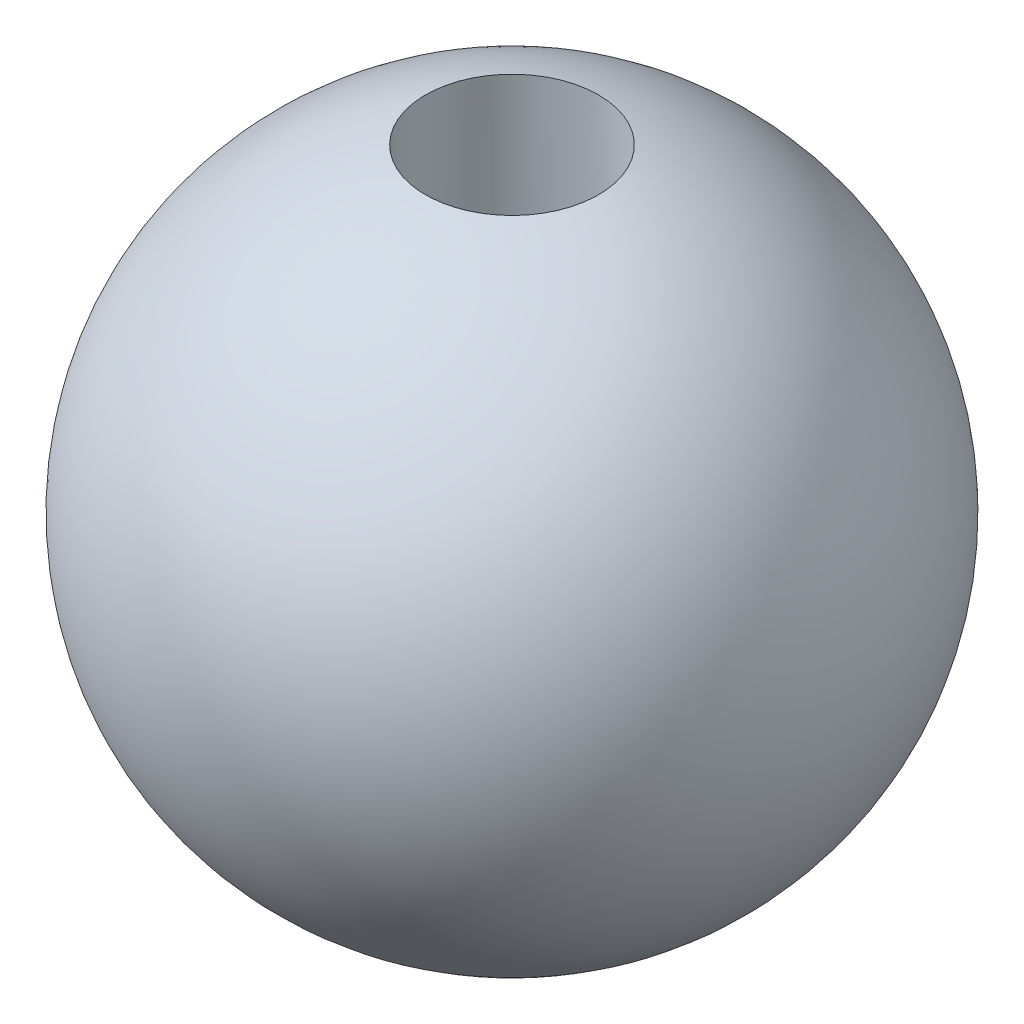
ISO-10303-21;
HEADER;
FILE_DESCRIPTION(('STEP AP214'),'2;1');
FILE_NAME('part.step','',(''),(''),'','','');
FILE_SCHEMA(('AUTOMOTIVE_DESIGN { 1 0 10303 214 1 1 1 1 }'));
ENDSEC;
DATA;
#1=APPLICATION_CONTEXT('core data for automotive mechanical design processes');
#2=APPLICATION_PROTOCOL_DEFINITION('international standard','automotive_design',2000,#1);
#3=PRODUCT_CONTEXT('',#1,'mechanical');
#4=PRODUCT('Part','Part','',(#3));
#5=PRODUCT_RELATED_PRODUCT_CATEGORY('part','',(#4));
#6=PRODUCT_DEFINITION_FORMATION('','',#4);
#7=PRODUCT_DEFINITION_CONTEXT('part definition',#1,'design');
#8=PRODUCT_DEFINITION('design','',#6,#7);
#9=PRODUCT_DEFINITION_SHAPE('','',#8);
#10=(LENGTH_UNIT() NAMED_UNIT(*) SI_UNIT(.MILLI.,.METRE.));
#11=(NAMED_UNIT(*) PLANE_ANGLE_UNIT() SI_UNIT($,.RADIAN.));
#12=(NAMED_UNIT(*) SI_UNIT($,.STERADIAN.) SOLID_ANGLE_UNIT());
#13=UNCERTAINTY_MEASURE_WITH_UNIT(LENGTH_MEASURE(1.E-05),#10,'distance_accuracy_value','');
#14=(GEOMETRIC_REPRESENTATION_CONTEXT(3) GLOBAL_UNCERTAINTY_ASSIGNED_CONTEXT((#13)) GLOBAL_UNIT_ASSIGNED_CONTEXT((#10,
#11,#12)) REPRESENTATION_CONTEXT('',''));
#15=CARTESIAN_POINT('',(0.,0.,0.));
#16=DIRECTION('',(0.,0.,1.));
#17=DIRECTION('',(1.,0.,0.));
#18=AXIS2_PLACEMENT_3D('',#15,#16,#17);
#19=CARTESIAN_POINT('',(16.25,-11.5,0.));
#20=DIRECTION('',(0.,-1.,0.));
#21=DIRECTION('',(0.,0.,-1.));
#22=AXIS2_PLACEMENT_3D('',#19,#20,#21);
#23=PLANE('',#22);
#24=DIRECTION('',(0.,0.,-1.));
#25=VECTOR('',#24,1.);
#26=CARTESIAN_POINT('',(14.25,-11.5,2.23606797749979));
#27=LINE('',#26,#25);
#28=CARTESIAN_POINT('',(14.25,-11.5,2.23606797749979));
#29=VERTEX_POINT('',#28);
#30=CARTESIAN_POINT('',(14.25,-11.5,-2.23606797749979));
#31=VERTEX_POINT('',#30);
#32=EDGE_CURVE('E89',#29,#31,#27,.T.);
#33=ORIENTED_EDGE('',*,*,#32,.F.);
#34=CARTESIAN_POINT('',(16.25,-11.5,0.));
#35=DIRECTION('',(0.,-1.,0.));
#36=DIRECTION('',(0.,0.,-1.));
#37=AXIS2_PLACEMENT_3D('',#34,#35,#36);
#38=CIRCLE('',#37,3.);
#39=EDGE_CURVE('E117',#29,#31,#38,.T.);
#40=ORIENTED_EDGE('',*,*,#39,.T.);
#41=EDGE_LOOP('',(#33,#40));
#42=FACE_BOUND('',#41,.T.);
#43=ADVANCED_FACE('F37',(#42),#23,.T.);
#44=CARTESIAN_POINT('',(16.25,0.,0.));
#45=DIRECTION('',(-1.,0.,0.));
#46=DIRECTION('',(0.,1.,0.));
#47=AXIS2_PLACEMENT_3D('',#44,#45,#46);
#48=SPHERICAL_SURFACE('',#47,16.25);
#49=CARTESIAN_POINT('',(16.25,0.,0.));
#50=DIRECTION('',(0.,-1.,0.));
#51=DIRECTION('',(0.,0.,-1.));
#52=AXIS2_PLACEMENT_3D('',#49,#50,#51);
#53=SPHERICAL_SURFACE('',#52,16.25);
#54=CARTESIAN_POINT('',(16.25,15.6796210399847,0.));
#55=DIRECTION('',(0.,-1.,0.));
#56=DIRECTION('',(0.,0.,-1.));
#57=AXIS2_PLACEMENT_3D('',#54,#55,#56);
#58=CIRCLE('',#57,4.26755012184662);
#59=CARTESIAN_POINT('',(16.25,15.6796210399847,-4.26755012184662));
#60=VERTEX_POINT('',#59);
#61=EDGE_CURVE('E12',#60,#60,#58,.T.);
#62=ORIENTED_EDGE('',*,*,#61,.T.);
#63=EDGE_LOOP('',(#62));
#64=FACE_BOUND('',#63,.T.);
#65=CARTESIAN_POINT('',(16.25,-15.4616460960662,0.));
#66=DIRECTION('',(0.,1.,0.));
#67=DIRECTION('',(0.,0.,1.));
#68=AXIS2_PLACEMENT_3D('',#65,#66,#67);
#69=CIRCLE('',#68,5.);
#70=CARTESIAN_POINT('',(16.25,-15.4616460960662,5.));
#71=VERTEX_POINT('',#70);
#72=EDGE_CURVE('E41',#71,#71,#69,.F.);
#73=ORIENTED_EDGE('',*,*,#72,.F.);
#74=EDGE_LOOP('',(#73));
#75=FACE_BOUND('',#74,.T.);
#76=ADVANCED_FACE('F39',(#64,#75),#53,.T.);
#77=CARTESIAN_POINT('',(16.25,16.25,0.));
#78=DIRECTION('',(0.,-1.,0.));
#79=DIRECTION('',(0.,0.,-1.));
#80=AXIS2_PLACEMENT_3D('',#77,#78,#79);
#81=CONICAL_SURFACE('',#80,4.25,0.0307595260704694);
#82=CARTESIAN_POINT('',(16.25,0.,0.));
#83=DIRECTION('',(0.,1.,0.));
#84=DIRECTION('',(0.,0.,1.));
#85=AXIS2_PLACEMENT_3D('',#82,#83,#84);
#86=CIRCLE('',#85,4.75);
#87=CARTESIAN_POINT('',(16.25,0.,4.75));
#88=VERTEX_POINT('',#87);
#89=EDGE_CURVE('E46',#88,#88,#86,.T.);
#90=ORIENTED_EDGE('',*,*,#89,.F.);
#91=EDGE_LOOP('',(#90));
#92=FACE_BOUND('',#91,.T.);
#93=ORIENTED_EDGE('',*,*,#61,.F.);
#94=EDGE_LOOP('',(#93));
#95=FACE_BOUND('',#94,.T.);
#96=ADVANCED_FACE('F130',(#92,#95),#81,.F.);
#97=CARTESIAN_POINT('',(16.25,0.,0.));
#98=DIRECTION('',(0.,1.,0.));
#99=DIRECTION('',(0.,0.,1.));
#100=AXIS2_PLACEMENT_3D('',#97,#98,#99);
#101=PLANE('',#100);
#102=ORIENTED_EDGE('',*,*,#89,.T.);
#103=EDGE_LOOP('',(#102));
#104=FACE_BOUND('',#103,.T.);
#105=ADVANCED_FACE('F139',(#104),#101,.T.);
#106=CARTESIAN_POINT('',(16.25,-14.,0.));
#107=DIRECTION('',(0.,-1.,0.));
#108=DIRECTION('',(0.,0.,-1.));
#109=AXIS2_PLACEMENT_3D('',#106,#107,#108);
#110=CYLINDRICAL_SURFACE('',#109,5.);
#111=CARTESIAN_POINT('',(16.25,-14.,0.));
#112=DIRECTION('',(0.,1.,0.));
#113=DIRECTION('',(0.,0.,1.));
#114=AXIS2_PLACEMENT_3D('',#111,#112,#113);
#115=CIRCLE('',#114,5.);
#116=CARTESIAN_POINT('',(16.25,-14.,5.));
#117=VERTEX_POINT('',#116);
#118=EDGE_CURVE('E116',#117,#117,#115,.T.);
#119=ORIENTED_EDGE('',*,*,#118,.T.);
#120=EDGE_LOOP('',(#119));
#121=FACE_BOUND('',#120,.T.);
#122=ORIENTED_EDGE('',*,*,#72,.T.);
#123=EDGE_LOOP('',(#122));
#124=FACE_BOUND('',#123,.T.);
#125=ADVANCED_FACE('F143',(#121,#124),#110,.F.);
#126=CARTESIAN_POINT('',(16.25,-14.,0.));
#127=DIRECTION('',(0.,1.,0.));
#128=DIRECTION('',(0.,0.,1.));
#129=AXIS2_PLACEMENT_3D('',#126,#127,#128);
#130=PLANE('',#129);
#131=CARTESIAN_POINT('',(16.25,-14.,0.));
#132=DIRECTION('',(0.,-1.,0.));
#133=DIRECTION('',(0.,0.,-1.));
#134=AXIS2_PLACEMENT_3D('',#131,#132,#133);
#135=CIRCLE('',#134,3.);
#136=CARTESIAN_POINT('',(16.25,-14.,-3.));
#137=VERTEX_POINT('',#136);
#138=EDGE_CURVE('E110',#137,#137,#135,.T.);
#139=ORIENTED_EDGE('',*,*,#138,.F.);
#140=EDGE_LOOP('',(#139));
#141=FACE_BOUND('',#140,.T.);
#142=ORIENTED_EDGE('',*,*,#118,.F.);
#143=EDGE_LOOP('',(#142));
#144=FACE_BOUND('',#143,.T.);
#145=ADVANCED_FACE('F182',(#141,#144),#130,.F.);
#146=CARTESIAN_POINT('',(16.25,-11.5,0.));
#147=DIRECTION('',(0.,-1.,0.));
#148=DIRECTION('',(0.,0.,-1.));
#149=AXIS2_PLACEMENT_3D('',#146,#147,#148);
#150=CYLINDRICAL_SURFACE('',#149,3.);
#151=CARTESIAN_POINT('',(18.25,-11.5,-2.23606797749979));
#152=VERTEX_POINT('',#151);
#153=CARTESIAN_POINT('',(18.25,-11.5,2.23606797749979));
#154=VERTEX_POINT('',#153);
#155=EDGE_CURVE('E113',#152,#154,#38,.T.);
#156=ORIENTED_EDGE('',*,*,#155,.F.);
#157=DIRECTION('',(0.,-1.,0.));
#158=VECTOR('',#157,1.);
#159=CARTESIAN_POINT('',(18.25,-4.5,-2.23606797749979));
#160=LINE('',#159,#158);
#161=CARTESIAN_POINT('',(18.25,-4.5,-2.23606797749979));
#162=VERTEX_POINT('',#161);
#163=EDGE_CURVE('E53',#162,#152,#160,.T.);
#164=ORIENTED_EDGE('',*,*,#163,.F.);
#165=CARTESIAN_POINT('',(16.25,-4.5,0.));
#166=DIRECTION('',(0.,-1.,0.));
#167=DIRECTION('',(0.,0.,-1.));
#168=AXIS2_PLACEMENT_3D('',#165,#166,#167);
#169=CIRCLE('',#168,3.);
#170=CARTESIAN_POINT('',(14.25,-4.5,-2.23606797749979));
#171=VERTEX_POINT('',#170);
#172=EDGE_CURVE('E93',#171,#162,#169,.T.);
#173=ORIENTED_EDGE('',*,*,#172,.F.);
#174=DIRECTION('',(0.,-1.,0.));
#175=VECTOR('',#174,1.);
#176=CARTESIAN_POINT('',(14.25,-4.5,-2.23606797749979));
#177=LINE('',#176,#175);
#178=EDGE_CURVE('E82',#171,#31,#177,.T.);
#179=ORIENTED_EDGE('',*,*,#178,.T.);
#180=ORIENTED_EDGE('',*,*,#39,.F.);
#181=DIRECTION('',(0.,-1.,0.));
#182=VECTOR('',#181,1.);
#183=CARTESIAN_POINT('',(14.25,-4.5,2.23606797749979));
#184=LINE('',#183,#182);
#185=CARTESIAN_POINT('',(14.25,-4.5,2.23606797749979));
#186=VERTEX_POINT('',#185);
#187=EDGE_CURVE('E77',#186,#29,#184,.T.);
#188=ORIENTED_EDGE('',*,*,#187,.F.);
#189=CARTESIAN_POINT('',(16.25,-4.5,0.));
#190=DIRECTION('',(0.,-1.,0.));
#191=DIRECTION('',(0.,0.,-1.));
#192=AXIS2_PLACEMENT_3D('',#189,#190,#191);
#193=CIRCLE('',#192,3.);
#194=CARTESIAN_POINT('',(18.25,-4.5,2.23606797749979));
#195=VERTEX_POINT('',#194);
#196=EDGE_CURVE('E101',#195,#186,#193,.T.);
#197=ORIENTED_EDGE('',*,*,#196,.F.);
#198=DIRECTION('',(0.,-1.,0.));
#199=VECTOR('',#198,1.);
#200=CARTESIAN_POINT('',(18.25,-4.5,2.23606797749979));
#201=LINE('',#200,#199);
#202=EDGE_CURVE('E59',#195,#154,#201,.T.);
#203=ORIENTED_EDGE('',*,*,#202,.T.);
#204=EDGE_LOOP('',(#156,#164,#173,#179,#180,#188,#197,#203));
#205=FACE_BOUND('',#204,.T.);
#206=ORIENTED_EDGE('',*,*,#138,.T.);
#207=EDGE_LOOP('',(#206));
#208=FACE_BOUND('',#207,.T.);
#209=ADVANCED_FACE('F94',(#205,#208),#150,.F.);
#210=DIRECTION('',(0.,0.,1.));
#211=VECTOR('',#210,1.);
#212=CARTESIAN_POINT('',(18.25,-11.5,2.23606797749979));
#213=LINE('',#212,#211);
#214=EDGE_CURVE('E103',#152,#154,#213,.T.);
#215=ORIENTED_EDGE('',*,*,#214,.F.);
#216=ORIENTED_EDGE('',*,*,#155,.T.);
#217=EDGE_LOOP('',(#215,#216));
#218=FACE_BOUND('',#217,.T.);
#219=ADVANCED_FACE('F167',(#218),#23,.T.);
#220=CARTESIAN_POINT('',(18.25,-4.5,2.23606797749979));
#221=DIRECTION('',(1.,0.,0.));
#222=DIRECTION('',(0.,0.,-1.));
#223=AXIS2_PLACEMENT_3D('',#220,#221,#222);
#224=PLANE('',#223);
#225=ORIENTED_EDGE('',*,*,#214,.T.);
#226=ORIENTED_EDGE('',*,*,#202,.F.);
#227=DIRECTION('',(0.,0.,1.));
#228=VECTOR('',#227,1.);
#229=CARTESIAN_POINT('',(18.25,-4.5,2.23606797749979));
#230=LINE('',#229,#228);
#231=EDGE_CURVE('E98',#162,#195,#230,.T.);
#232=ORIENTED_EDGE('',*,*,#231,.F.);
#233=ORIENTED_EDGE('',*,*,#163,.T.);
#234=EDGE_LOOP('',(#225,#226,#232,#233));
#235=FACE_BOUND('',#234,.T.);
#236=ADVANCED_FACE('F175',(#235),#224,.F.);
#237=CARTESIAN_POINT('',(14.25,-4.5,2.23606797749979));
#238=DIRECTION('',(-1.,0.,0.));
#239=DIRECTION('',(0.,0.,1.));
#240=AXIS2_PLACEMENT_3D('',#237,#238,#239);
#241=PLANE('',#240);
#242=ORIENTED_EDGE('',*,*,#32,.T.);
#243=ORIENTED_EDGE('',*,*,#178,.F.);
#244=DIRECTION('',(0.,0.,-1.));
#245=VECTOR('',#244,1.);
#246=CARTESIAN_POINT('',(14.25,-4.5,2.23606797749979));
#247=LINE('',#246,#245);
#248=EDGE_CURVE('E86',#186,#171,#247,.T.);
#249=ORIENTED_EDGE('',*,*,#248,.F.);
#250=ORIENTED_EDGE('',*,*,#187,.T.);
#251=EDGE_LOOP('',(#242,#243,#249,#250));
#252=FACE_BOUND('',#251,.T.);
#253=ADVANCED_FACE('F84',(#252),#241,.F.);
#254=CARTESIAN_POINT('',(16.25,-4.5,0.));
#255=DIRECTION('',(0.,-1.,0.));
#256=DIRECTION('',(0.,0.,-1.));
#257=AXIS2_PLACEMENT_3D('',#254,#255,#256);
#258=PLANE('',#257);
#259=ORIENTED_EDGE('',*,*,#196,.T.);
#260=ORIENTED_EDGE('',*,*,#248,.T.);
#261=ORIENTED_EDGE('',*,*,#172,.T.);
#262=ORIENTED_EDGE('',*,*,#231,.T.);
#263=EDGE_LOOP('',(#259,#260,#261,#262));
#264=FACE_BOUND('',#263,.T.);
#265=ADVANCED_FACE('F100',(#264),#258,.T.);
#266=CLOSED_SHELL('',(#43,#76,#96,#105,#125,#145,#209,#219,#236,#253,#265));
#267=MANIFOLD_SOLID_BREP('B2',#266);
#268=ADVANCED_BREP_SHAPE_REPRESENTATION('',(#18,#267),#14);
#269=SHAPE_DEFINITION_REPRESENTATION(#9,#268);
ENDSEC;
END-ISO-10303-21;
